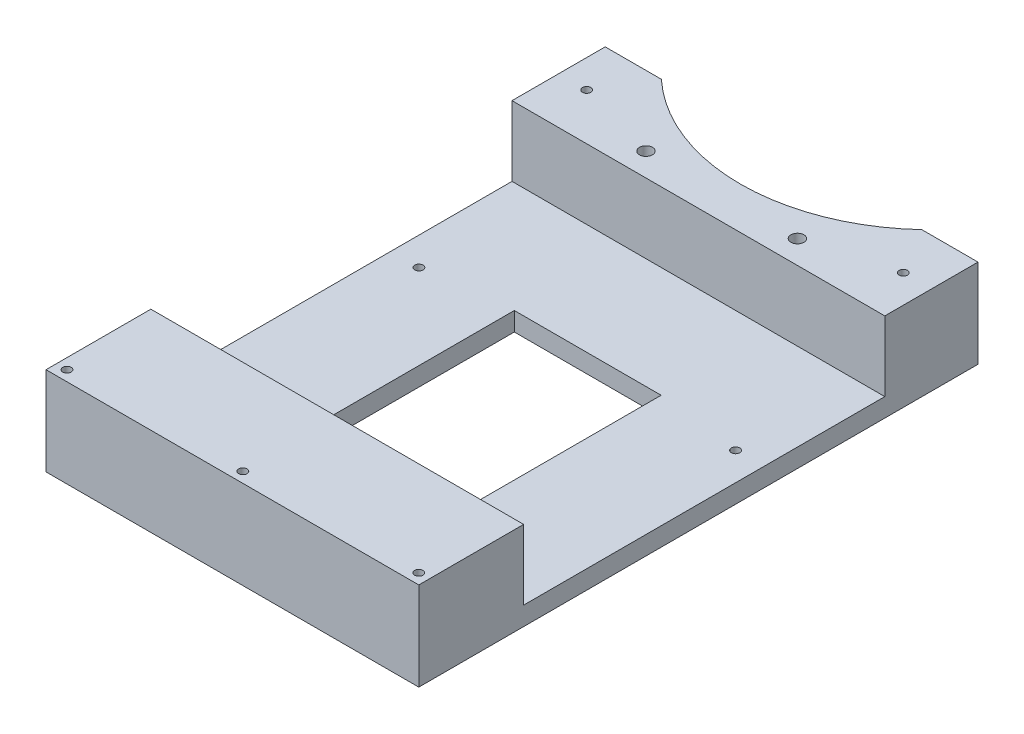
ISO-10303-21;
HEADER;
FILE_DESCRIPTION(('STEP AP214'),'2;1');
FILE_NAME('part.step','',(''),(''),'','','');
FILE_SCHEMA(('AUTOMOTIVE_DESIGN { 1 0 10303 214 1 1 1 1 }'));
ENDSEC;
DATA;
#1=APPLICATION_CONTEXT('core data for automotive mechanical design processes');
#2=APPLICATION_PROTOCOL_DEFINITION('international standard','automotive_design',2000,#1);
#3=PRODUCT_CONTEXT('',#1,'mechanical');
#4=PRODUCT('Part','Part','',(#3));
#5=PRODUCT_RELATED_PRODUCT_CATEGORY('part','',(#4));
#6=PRODUCT_DEFINITION_FORMATION('','',#4);
#7=PRODUCT_DEFINITION_CONTEXT('part definition',#1,'design');
#8=PRODUCT_DEFINITION('design','',#6,#7);
#9=PRODUCT_DEFINITION_SHAPE('','',#8);
#10=(LENGTH_UNIT() NAMED_UNIT(*) SI_UNIT(.MILLI.,.METRE.));
#11=(NAMED_UNIT(*) PLANE_ANGLE_UNIT() SI_UNIT($,.RADIAN.));
#12=(NAMED_UNIT(*) SI_UNIT($,.STERADIAN.) SOLID_ANGLE_UNIT());
#13=UNCERTAINTY_MEASURE_WITH_UNIT(LENGTH_MEASURE(1.E-05),#10,'distance_accuracy_value','');
#14=(GEOMETRIC_REPRESENTATION_CONTEXT(3) GLOBAL_UNCERTAINTY_ASSIGNED_CONTEXT((#13)) GLOBAL_UNIT_ASSIGNED_CONTEXT((#10,
#11,#12)) REPRESENTATION_CONTEXT('',''));
#15=CARTESIAN_POINT('',(0.,0.,0.));
#16=DIRECTION('',(0.,0.,1.));
#17=DIRECTION('',(1.,0.,0.));
#18=AXIS2_PLACEMENT_3D('',#15,#16,#17);
#19=CARTESIAN_POINT('',(4.99999999999989,4.,-82.5000000000002));
#20=DIRECTION('',(0.,-1.,0.));
#21=DIRECTION('',(0.,0.,-1.));
#22=AXIS2_PLACEMENT_3D('',#19,#20,#21);
#23=PLANE('',#22);
#24=CARTESIAN_POINT('',(38.9749999999999,4.,-6.50000000000017));
#25=DIRECTION('',(0.,-1.,0.));
#26=DIRECTION('',(0.,0.,1.));
#27=AXIS2_PLACEMENT_3D('',#24,#25,#26);
#28=CIRCLE('',#27,0.899999999999997);
#29=CARTESIAN_POINT('',(38.9749999999999,4.,-5.60000000000018));
#30=VERTEX_POINT('',#29);
#31=EDGE_CURVE('E308',#30,#30,#28,.T.);
#32=ORIENTED_EDGE('',*,*,#31,.T.);
#33=EDGE_LOOP('',(#32));
#34=FACE_BOUND('',#33,.T.);
#35=CARTESIAN_POINT('',(-28.9750000000001,4.,-6.50000000000017));
#36=DIRECTION('',(0.,-1.,0.));
#37=DIRECTION('',(0.,0.,1.));
#38=AXIS2_PLACEMENT_3D('',#35,#36,#37);
#39=CIRCLE('',#38,0.899999999999997);
#40=CARTESIAN_POINT('',(-28.9750000000001,4.,-5.60000000000018));
#41=VERTEX_POINT('',#40);
#42=EDGE_CURVE('E323',#41,#41,#39,.T.);
#43=ORIENTED_EDGE('',*,*,#42,.T.);
#44=EDGE_LOOP('',(#43));
#45=FACE_BOUND('',#44,.T.);
#46=DIRECTION('',(0.,0.,1.));
#47=VECTOR('',#46,1.);
#48=CARTESIAN_POINT('',(20.7499999999999,4.,40.7499999999998));
#49=LINE('',#48,#47);
#50=CARTESIAN_POINT('',(20.7499999999999,4.,-8.75000000000017));
#51=VERTEX_POINT('',#50);
#52=CARTESIAN_POINT('',(20.7499999999999,4.,40.7499999999998));
#53=VERTEX_POINT('',#52);
#54=EDGE_CURVE('E345',#51,#53,#49,.T.);
#55=ORIENTED_EDGE('',*,*,#54,.T.);
#56=DIRECTION('',(-1.,0.,0.));
#57=VECTOR('',#56,1.);
#58=CARTESIAN_POINT('',(-10.7500000000001,4.,40.7499999999998));
#59=LINE('',#58,#57);
#60=CARTESIAN_POINT('',(-10.7500000000001,4.,40.7499999999998));
#61=VERTEX_POINT('',#60);
#62=EDGE_CURVE('E335',#53,#61,#59,.T.);
#63=ORIENTED_EDGE('',*,*,#62,.T.);
#64=DIRECTION('',(0.,0.,-1.));
#65=VECTOR('',#64,1.);
#66=CARTESIAN_POINT('',(-10.7500000000001,4.,-8.75000000000018));
#67=LINE('',#66,#65);
#68=CARTESIAN_POINT('',(-10.7500000000001,4.,-8.75000000000017));
#69=VERTEX_POINT('',#68);
#70=EDGE_CURVE('E338',#61,#69,#67,.T.);
#71=ORIENTED_EDGE('',*,*,#70,.T.);
#72=DIRECTION('',(1.,0.,0.));
#73=VECTOR('',#72,1.);
#74=CARTESIAN_POINT('',(20.7499999999999,4.,-8.75000000000017));
#75=LINE('',#74,#73);
#76=EDGE_CURVE('E342',#69,#51,#75,.T.);
#77=ORIENTED_EDGE('',*,*,#76,.T.);
#78=EDGE_LOOP('',(#55,#63,#71,#77));
#79=FACE_BOUND('',#78,.T.);
#80=DIRECTION('',(1.,0.,0.));
#81=VECTOR('',#80,1.);
#82=CARTESIAN_POINT('',(44.9999999999999,4.,-32.5000000000002));
#83=LINE('',#82,#81);
#84=CARTESIAN_POINT('',(-35.0000000000001,4.,-32.5000000000002));
#85=VERTEX_POINT('',#84);
#86=CARTESIAN_POINT('',(44.9999999999999,4.,-32.5000000000002));
#87=VERTEX_POINT('',#86);
#88=EDGE_CURVE('E257',#85,#87,#83,.T.);
#89=ORIENTED_EDGE('',*,*,#88,.F.);
#90=DIRECTION('',(0.,0.,-1.));
#91=VECTOR('',#90,1.);
#92=CARTESIAN_POINT('',(-35.0000000000001,4.,67.4999999999998));
#93=LINE('',#92,#91);
#94=CARTESIAN_POINT('',(-35.0000000000001,4.,44.9999999999998));
#95=VERTEX_POINT('',#94);
#96=EDGE_CURVE('E369',#95,#85,#93,.T.);
#97=ORIENTED_EDGE('',*,*,#96,.F.);
#98=DIRECTION('',(-1.,0.,0.));
#99=VECTOR('',#98,1.);
#100=CARTESIAN_POINT('',(44.9999999999999,4.,44.9999999999998));
#101=LINE('',#100,#99);
#102=CARTESIAN_POINT('',(-31.0000000000001,4.,44.9999999999998));
#103=VERTEX_POINT('',#102);
#104=EDGE_CURVE('E280',#103,#95,#101,.T.);
#105=ORIENTED_EDGE('',*,*,#104,.F.);
#106=DIRECTION('',(0.,0.,-1.));
#107=VECTOR('',#106,1.);
#108=CARTESIAN_POINT('',(-31.0000000000001,4.,140.33543093852));
#109=LINE('',#108,#107);
#110=CARTESIAN_POINT('',(-31.0000000000001,4.,63.4999999999998));
#111=VERTEX_POINT('',#110);
#112=EDGE_CURVE('E51',#111,#103,#109,.T.);
#113=ORIENTED_EDGE('',*,*,#112,.F.);
#114=DIRECTION('',(-1.,0.,0.));
#115=VECTOR('',#114,1.);
#116=CARTESIAN_POINT('',(-31.0000000000001,4.,63.4999999999998));
#117=LINE('',#116,#115);
#118=CARTESIAN_POINT('',(40.9999999999999,3.99999999999999,63.4999999999998));
#119=VERTEX_POINT('',#118);
#120=EDGE_CURVE('E216',#119,#111,#117,.T.);
#121=ORIENTED_EDGE('',*,*,#120,.F.);
#122=DIRECTION('',(0.,0.,-1.));
#123=VECTOR('',#122,1.);
#124=CARTESIAN_POINT('',(40.9999999999999,3.99999999999999,140.33543093852));
#125=LINE('',#124,#123);
#126=CARTESIAN_POINT('',(40.9999999999999,3.99999999999999,44.9999999999998));
#127=VERTEX_POINT('',#126);
#128=EDGE_CURVE('E191',#119,#127,#125,.T.);
#129=ORIENTED_EDGE('',*,*,#128,.T.);
#130=CARTESIAN_POINT('',(44.9999999999999,4.,44.9999999999998));
#131=VERTEX_POINT('',#130);
#132=EDGE_CURVE('E285',#131,#127,#101,.T.);
#133=ORIENTED_EDGE('',*,*,#132,.F.);
#134=DIRECTION('',(0.,0.,1.));
#135=VECTOR('',#134,1.);
#136=CARTESIAN_POINT('',(44.9999999999999,4.,-52.5000000000002));
#137=LINE('',#136,#135);
#138=EDGE_CURVE('E367',#87,#131,#137,.T.);
#139=ORIENTED_EDGE('',*,*,#138,.F.);
#140=EDGE_LOOP('',(#89,#97,#105,#113,#121,#129,#133,#139));
#141=FACE_BOUND('',#140,.T.);
#142=ADVANCED_FACE('F34',(#34,#45,#79,#141),#23,.F.);
#143=CARTESIAN_POINT('',(4.99999999999989,4.,-82.5000000000002));
#144=DIRECTION('',(0.,-1.,0.));
#145=DIRECTION('',(0.,0.,-1.));
#146=AXIS2_PLACEMENT_3D('',#143,#144,#145);
#147=CYLINDRICAL_SURFACE('',#146,41.);
#148=CARTESIAN_POINT('',(4.99999999999989,0.,-82.5000000000002));
#149=DIRECTION('',(0.,1.,0.));
#150=DIRECTION('',(0.,0.,-1.));
#151=AXIS2_PLACEMENT_3D('',#148,#149,#150);
#152=CIRCLE('',#151,41.);
#153=CARTESIAN_POINT('',(-22.9463772249644,0.,-52.5000000000002));
#154=VERTEX_POINT('',#153);
#155=CARTESIAN_POINT('',(32.9463772249641,0.,-52.5000000000002));
#156=VERTEX_POINT('',#155);
#157=EDGE_CURVE('E360',#154,#156,#152,.T.);
#158=ORIENTED_EDGE('',*,*,#157,.F.);
#159=DIRECTION('',(0.,-1.,0.));
#160=VECTOR('',#159,1.);
#161=CARTESIAN_POINT('',(-22.9463772249644,4.,-52.5000000000002));
#162=LINE('',#161,#160);
#163=CARTESIAN_POINT('',(-22.9463772249644,19.,-52.5000000000002));
#164=VERTEX_POINT('',#163);
#165=EDGE_CURVE('E12',#164,#154,#162,.T.);
#166=ORIENTED_EDGE('',*,*,#165,.F.);
#167=CARTESIAN_POINT('',(4.99999999999988,19.,-82.5000000000002));
#168=DIRECTION('',(0.,-1.,0.));
#169=DIRECTION('',(0.,0.,1.));
#170=AXIS2_PLACEMENT_3D('',#167,#168,#169);
#171=CIRCLE('',#170,41.);
#172=CARTESIAN_POINT('',(32.9463772249641,19.,-52.5000000000002));
#173=VERTEX_POINT('',#172);
#174=EDGE_CURVE('E264',#173,#164,#171,.T.);
#175=ORIENTED_EDGE('',*,*,#174,.F.);
#176=DIRECTION('',(0.,-1.,0.));
#177=VECTOR('',#176,1.);
#178=CARTESIAN_POINT('',(32.9463772249641,4.,-52.5000000000002));
#179=LINE('',#178,#177);
#180=EDGE_CURVE('E38',#173,#156,#179,.T.);
#181=ORIENTED_EDGE('',*,*,#180,.T.);
#182=EDGE_LOOP('',(#158,#166,#175,#181));
#183=FACE_BOUND('',#182,.T.);
#184=ADVANCED_FACE('F36',(#183),#147,.F.);
#185=CARTESIAN_POINT('',(-35.0000000000001,4.,-52.5000000000002));
#186=DIRECTION('',(0.,0.,-1.));
#187=DIRECTION('',(-1.,0.,0.));
#188=AXIS2_PLACEMENT_3D('',#185,#186,#187);
#189=PLANE('',#188);
#190=DIRECTION('',(1.,0.,0.));
#191=VECTOR('',#190,1.);
#192=CARTESIAN_POINT('',(-35.0000000000001,0.,-52.5000000000002));
#193=LINE('',#192,#191);
#194=CARTESIAN_POINT('',(-35.0000000000001,0.,-52.5000000000002));
#195=VERTEX_POINT('',#194);
#196=EDGE_CURVE('E370',#195,#154,#193,.T.);
#197=ORIENTED_EDGE('',*,*,#196,.F.);
#198=DIRECTION('',(0.,-1.,0.));
#199=VECTOR('',#198,1.);
#200=CARTESIAN_POINT('',(-35.0000000000001,4.,-52.5000000000002));
#201=LINE('',#200,#199);
#202=CARTESIAN_POINT('',(-35.0000000000001,19.,-52.5000000000002));
#203=VERTEX_POINT('',#202);
#204=EDGE_CURVE('E43',#203,#195,#201,.T.);
#205=ORIENTED_EDGE('',*,*,#204,.F.);
#206=DIRECTION('',(-1.,0.,0.));
#207=VECTOR('',#206,1.);
#208=CARTESIAN_POINT('',(-35.0000000000001,19.,-52.5000000000002));
#209=LINE('',#208,#207);
#210=EDGE_CURVE('E267',#164,#203,#209,.T.);
#211=ORIENTED_EDGE('',*,*,#210,.F.);
#212=ORIENTED_EDGE('',*,*,#165,.T.);
#213=EDGE_LOOP('',(#197,#205,#211,#212));
#214=FACE_BOUND('',#213,.T.);
#215=ADVANCED_FACE('F407',(#214),#189,.T.);
#216=CARTESIAN_POINT('',(-35.0000000000001,4.,67.4999999999998));
#217=DIRECTION('',(-1.,0.,0.));
#218=DIRECTION('',(0.,0.,1.));
#219=AXIS2_PLACEMENT_3D('',#216,#217,#218);
#220=PLANE('',#219);
#221=DIRECTION('',(0.,0.,-1.));
#222=VECTOR('',#221,1.);
#223=CARTESIAN_POINT('',(-35.0000000000001,0.,67.4999999999998));
#224=LINE('',#223,#222);
#225=CARTESIAN_POINT('',(-35.0000000000001,0.,67.4999999999998));
#226=VERTEX_POINT('',#225);
#227=EDGE_CURVE('E384',#226,#195,#224,.T.);
#228=ORIENTED_EDGE('',*,*,#227,.F.);
#229=DIRECTION('',(0.,-1.,0.));
#230=VECTOR('',#229,1.);
#231=CARTESIAN_POINT('',(-35.0000000000001,4.,67.4999999999998));
#232=LINE('',#231,#230);
#233=CARTESIAN_POINT('',(-35.0000000000001,19.,67.4999999999998));
#234=VERTEX_POINT('',#233);
#235=EDGE_CURVE('E390',#234,#226,#232,.T.);
#236=ORIENTED_EDGE('',*,*,#235,.F.);
#237=DIRECTION('',(0.,0.,1.));
#238=VECTOR('',#237,1.);
#239=CARTESIAN_POINT('',(-35.0000000000001,19.,67.4999999999998));
#240=LINE('',#239,#238);
#241=CARTESIAN_POINT('',(-35.0000000000001,19.,44.9999999999998));
#242=VERTEX_POINT('',#241);
#243=EDGE_CURVE('E287',#242,#234,#240,.T.);
#244=ORIENTED_EDGE('',*,*,#243,.F.);
#245=DIRECTION('',(0.,-1.,0.));
#246=VECTOR('',#245,1.);
#247=CARTESIAN_POINT('',(-35.0000000000001,19.,44.9999999999998));
#248=LINE('',#247,#246);
#249=EDGE_CURVE('E293',#242,#95,#248,.T.);
#250=ORIENTED_EDGE('',*,*,#249,.T.);
#251=ORIENTED_EDGE('',*,*,#96,.T.);
#252=DIRECTION('',(0.,-1.,0.));
#253=VECTOR('',#252,1.);
#254=CARTESIAN_POINT('',(-35.0000000000001,19.,-32.5000000000002));
#255=LINE('',#254,#253);
#256=CARTESIAN_POINT('',(-35.0000000000001,19.,-32.5000000000002));
#257=VERTEX_POINT('',#256);
#258=EDGE_CURVE('E278',#257,#85,#255,.T.);
#259=ORIENTED_EDGE('',*,*,#258,.F.);
#260=DIRECTION('',(0.,0.,1.));
#261=VECTOR('',#260,1.);
#262=CARTESIAN_POINT('',(-35.0000000000001,19.,-32.5000000000002));
#263=LINE('',#262,#261);
#264=EDGE_CURVE('E270',#203,#257,#263,.T.);
#265=ORIENTED_EDGE('',*,*,#264,.F.);
#266=ORIENTED_EDGE('',*,*,#204,.T.);
#267=EDGE_LOOP('',(#228,#236,#244,#250,#251,#259,#265,#266));
#268=FACE_BOUND('',#267,.T.);
#269=ADVANCED_FACE('F425',(#268),#220,.T.);
#270=CARTESIAN_POINT('',(44.9999999999999,4.,67.4999999999998));
#271=DIRECTION('',(0.,0.,1.));
#272=DIRECTION('',(1.,0.,0.));
#273=AXIS2_PLACEMENT_3D('',#270,#271,#272);
#274=PLANE('',#273);
#275=DIRECTION('',(-1.,0.,0.));
#276=VECTOR('',#275,1.);
#277=CARTESIAN_POINT('',(44.9999999999999,0.,67.4999999999998));
#278=LINE('',#277,#276);
#279=CARTESIAN_POINT('',(44.9999999999999,0.,67.4999999999998));
#280=VERTEX_POINT('',#279);
#281=EDGE_CURVE('E381',#280,#226,#278,.T.);
#282=ORIENTED_EDGE('',*,*,#281,.F.);
#283=DIRECTION('',(0.,-1.,0.));
#284=VECTOR('',#283,1.);
#285=CARTESIAN_POINT('',(44.9999999999999,4.,67.4999999999998));
#286=LINE('',#285,#284);
#287=CARTESIAN_POINT('',(44.9999999999999,19.,67.4999999999998));
#288=VERTEX_POINT('',#287);
#289=EDGE_CURVE('E392',#288,#280,#286,.T.);
#290=ORIENTED_EDGE('',*,*,#289,.F.);
#291=DIRECTION('',(1.,0.,0.));
#292=VECTOR('',#291,1.);
#293=CARTESIAN_POINT('',(44.9999999999999,19.,67.4999999999998));
#294=LINE('',#293,#292);
#295=EDGE_CURVE('E290',#234,#288,#294,.T.);
#296=ORIENTED_EDGE('',*,*,#295,.F.);
#297=ORIENTED_EDGE('',*,*,#235,.T.);
#298=EDGE_LOOP('',(#282,#290,#296,#297));
#299=FACE_BOUND('',#298,.T.);
#300=ADVANCED_FACE('F421',(#299),#274,.T.);
#301=CARTESIAN_POINT('',(44.9999999999999,4.,-52.5000000000002));
#302=DIRECTION('',(1.,0.,0.));
#303=DIRECTION('',(0.,0.,-1.));
#304=AXIS2_PLACEMENT_3D('',#301,#302,#303);
#305=PLANE('',#304);
#306=DIRECTION('',(0.,0.,1.));
#307=VECTOR('',#306,1.);
#308=CARTESIAN_POINT('',(44.9999999999999,0.,-52.5000000000002));
#309=LINE('',#308,#307);
#310=CARTESIAN_POINT('',(44.9999999999999,0.,-52.5000000000002));
#311=VERTEX_POINT('',#310);
#312=EDGE_CURVE('E378',#311,#280,#309,.T.);
#313=ORIENTED_EDGE('',*,*,#312,.F.);
#314=DIRECTION('',(0.,-1.,0.));
#315=VECTOR('',#314,1.);
#316=CARTESIAN_POINT('',(44.9999999999999,4.,-52.5000000000002));
#317=LINE('',#316,#315);
#318=CARTESIAN_POINT('',(44.9999999999999,19.,-52.5000000000002));
#319=VERTEX_POINT('',#318);
#320=EDGE_CURVE('E393',#319,#311,#317,.T.);
#321=ORIENTED_EDGE('',*,*,#320,.F.);
#322=DIRECTION('',(0.,0.,-1.));
#323=VECTOR('',#322,1.);
#324=CARTESIAN_POINT('',(44.9999999999999,19.,-32.5000000000002));
#325=LINE('',#324,#323);
#326=CARTESIAN_POINT('',(44.9999999999999,19.,-32.5000000000002));
#327=VERTEX_POINT('',#326);
#328=EDGE_CURVE('E258',#327,#319,#325,.T.);
#329=ORIENTED_EDGE('',*,*,#328,.F.);
#330=DIRECTION('',(0.,-1.,0.));
#331=VECTOR('',#330,1.);
#332=CARTESIAN_POINT('',(44.9999999999999,19.,-32.5000000000002));
#333=LINE('',#332,#331);
#334=EDGE_CURVE('E274',#327,#87,#333,.T.);
#335=ORIENTED_EDGE('',*,*,#334,.T.);
#336=ORIENTED_EDGE('',*,*,#138,.T.);
#337=DIRECTION('',(0.,-1.,0.));
#338=VECTOR('',#337,1.);
#339=CARTESIAN_POINT('',(44.9999999999999,19.,44.9999999999998));
#340=LINE('',#339,#338);
#341=CARTESIAN_POINT('',(44.9999999999999,19.,44.9999999999998));
#342=VERTEX_POINT('',#341);
#343=EDGE_CURVE('E298',#342,#131,#340,.T.);
#344=ORIENTED_EDGE('',*,*,#343,.F.);
#345=DIRECTION('',(0.,0.,-1.));
#346=VECTOR('',#345,1.);
#347=CARTESIAN_POINT('',(44.9999999999999,19.,67.4999999999998));
#348=LINE('',#347,#346);
#349=EDGE_CURVE('E281',#288,#342,#348,.T.);
#350=ORIENTED_EDGE('',*,*,#349,.F.);
#351=ORIENTED_EDGE('',*,*,#289,.T.);
#352=EDGE_LOOP('',(#313,#321,#329,#335,#336,#344,#350,#351));
#353=FACE_BOUND('',#352,.T.);
#354=ADVANCED_FACE('F416',(#353),#305,.T.);
#355=CARTESIAN_POINT('',(32.9463772249641,4.,-52.5000000000002));
#356=DIRECTION('',(0.,0.,-1.));
#357=DIRECTION('',(-1.,0.,0.));
#358=AXIS2_PLACEMENT_3D('',#355,#356,#357);
#359=PLANE('',#358);
#360=DIRECTION('',(1.,0.,0.));
#361=VECTOR('',#360,1.);
#362=CARTESIAN_POINT('',(32.9463772249641,0.,-52.5000000000002));
#363=LINE('',#362,#361);
#364=EDGE_CURVE('E375',#156,#311,#363,.T.);
#365=ORIENTED_EDGE('',*,*,#364,.F.);
#366=ORIENTED_EDGE('',*,*,#180,.F.);
#367=DIRECTION('',(-1.,0.,0.));
#368=VECTOR('',#367,1.);
#369=CARTESIAN_POINT('',(32.9463772249641,19.,-52.5000000000002));
#370=LINE('',#369,#368);
#371=EDGE_CURVE('E261',#319,#173,#370,.T.);
#372=ORIENTED_EDGE('',*,*,#371,.F.);
#373=ORIENTED_EDGE('',*,*,#320,.T.);
#374=EDGE_LOOP('',(#365,#366,#372,#373));
#375=FACE_BOUND('',#374,.T.);
#376=ADVANCED_FACE('F401',(#375),#359,.T.);
#377=CARTESIAN_POINT('',(4.99999999999989,0.,-82.5000000000002));
#378=DIRECTION('',(0.,-1.,0.));
#379=DIRECTION('',(0.,0.,-1.));
#380=AXIS2_PLACEMENT_3D('',#377,#378,#379);
#381=PLANE('',#380);
#382=CARTESIAN_POINT('',(-28.9750000000001,0.,-42.5000000000001));
#383=DIRECTION('',(0.,1.,0.));
#384=DIRECTION('',(0.,0.,1.));
#385=AXIS2_PLACEMENT_3D('',#382,#383,#384);
#386=CIRCLE('',#385,0.899999999999996);
#387=CARTESIAN_POINT('',(-28.1580065312772,0.,-42.1224795739777));
#388=VERTEX_POINT('',#387);
#389=CARTESIAN_POINT('',(-29.791993468723,0.,-42.1224795739777));
#390=VERTEX_POINT('',#389);
#391=EDGE_CURVE('E231',#388,#390,#386,.T.);
#392=ORIENTED_EDGE('',*,*,#391,.T.);
#393=CARTESIAN_POINT('',(-28.9750000000001,0.,-41.7449591479553));
#394=DIRECTION('',(0.,-1.,0.));
#395=DIRECTION('',(0.,0.,-1.));
#396=AXIS2_PLACEMENT_3D('',#393,#394,#395);
#397=CIRCLE('',#396,0.9);
#398=EDGE_CURVE('E301',#388,#390,#397,.T.);
#399=ORIENTED_EDGE('',*,*,#398,.F.);
#400=EDGE_LOOP('',(#392,#399));
#401=FACE_BOUND('',#400,.T.);
#402=CARTESIAN_POINT('',(38.9749999999999,0.,-42.5000000000002));
#403=DIRECTION('',(0.,1.,0.));
#404=DIRECTION('',(0.,0.,1.));
#405=AXIS2_PLACEMENT_3D('',#402,#403,#404);
#406=CIRCLE('',#405,0.899999999999996);
#407=CARTESIAN_POINT('',(39.7919934687228,0.,-42.1224795739777));
#408=VERTEX_POINT('',#407);
#409=CARTESIAN_POINT('',(38.158006531277,0.,-42.1224795739777));
#410=VERTEX_POINT('',#409);
#411=EDGE_CURVE('E243',#408,#410,#406,.T.);
#412=ORIENTED_EDGE('',*,*,#411,.T.);
#413=CARTESIAN_POINT('',(38.9749999999999,0.,-41.7449591479553));
#414=DIRECTION('',(0.,-1.,0.));
#415=DIRECTION('',(0.,0.,-1.));
#416=AXIS2_PLACEMENT_3D('',#413,#414,#415);
#417=CIRCLE('',#416,0.899999999999996);
#418=EDGE_CURVE('E326',#408,#410,#417,.T.);
#419=ORIENTED_EDGE('',*,*,#418,.F.);
#420=EDGE_LOOP('',(#412,#419));
#421=FACE_BOUND('',#420,.T.);
#422=CARTESIAN_POINT('',(38.9749999999999,0.,-6.50000000000017));
#423=DIRECTION('',(0.,-1.,0.));
#424=DIRECTION('',(0.,0.,1.));
#425=AXIS2_PLACEMENT_3D('',#422,#423,#424);
#426=CIRCLE('',#425,0.899999999999997);
#427=CARTESIAN_POINT('',(38.9749999999999,0.,-5.60000000000018));
#428=VERTEX_POINT('',#427);
#429=EDGE_CURVE('E305',#428,#428,#426,.T.);
#430=ORIENTED_EDGE('',*,*,#429,.F.);
#431=EDGE_LOOP('',(#430));
#432=FACE_BOUND('',#431,.T.);
#433=CARTESIAN_POINT('',(42.7499999999999,0.,65.2499999999998));
#434=DIRECTION('',(0.,-1.,0.));
#435=DIRECTION('',(0.,0.,1.));
#436=AXIS2_PLACEMENT_3D('',#433,#434,#435);
#437=CIRCLE('',#436,0.900000000000012);
#438=CARTESIAN_POINT('',(42.7499999999999,0.,66.1499999999998));
#439=VERTEX_POINT('',#438);
#440=EDGE_CURVE('E311',#439,#439,#437,.T.);
#441=ORIENTED_EDGE('',*,*,#440,.F.);
#442=EDGE_LOOP('',(#441));
#443=FACE_BOUND('',#442,.T.);
#444=CARTESIAN_POINT('',(4.99999999999989,0.,65.2499999999998));
#445=DIRECTION('',(0.,-1.,0.));
#446=DIRECTION('',(0.,0.,1.));
#447=AXIS2_PLACEMENT_3D('',#444,#445,#446);
#448=CIRCLE('',#447,0.90000000000001);
#449=CARTESIAN_POINT('',(4.99999999999989,0.,66.1499999999998));
#450=VERTEX_POINT('',#449);
#451=EDGE_CURVE('E316',#450,#450,#448,.T.);
#452=ORIENTED_EDGE('',*,*,#451,.F.);
#453=EDGE_LOOP('',(#452));
#454=FACE_BOUND('',#453,.T.);
#455=CARTESIAN_POINT('',(-32.7500000000001,0.,65.2499999999998));
#456=DIRECTION('',(0.,-1.,0.));
#457=DIRECTION('',(0.,0.,1.));
#458=AXIS2_PLACEMENT_3D('',#455,#456,#457);
#459=CIRCLE('',#458,0.90000000000001);
#460=CARTESIAN_POINT('',(-32.7500000000001,0.,66.1499999999998));
#461=VERTEX_POINT('',#460);
#462=EDGE_CURVE('E319',#461,#461,#459,.T.);
#463=ORIENTED_EDGE('',*,*,#462,.F.);
#464=EDGE_LOOP('',(#463));
#465=FACE_BOUND('',#464,.T.);
#466=CARTESIAN_POINT('',(-28.9750000000001,0.,-6.50000000000017));
#467=DIRECTION('',(0.,-1.,0.));
#468=DIRECTION('',(0.,0.,1.));
#469=AXIS2_PLACEMENT_3D('',#466,#467,#468);
#470=CIRCLE('',#469,0.899999999999997);
#471=CARTESIAN_POINT('',(-28.9750000000001,0.,-5.60000000000018));
#472=VERTEX_POINT('',#471);
#473=EDGE_CURVE('E322',#472,#472,#470,.T.);
#474=ORIENTED_EDGE('',*,*,#473,.F.);
#475=EDGE_LOOP('',(#474));
#476=FACE_BOUND('',#475,.T.);
#477=DIRECTION('',(-1.,0.,0.));
#478=VECTOR('',#477,1.);
#479=CARTESIAN_POINT('',(-10.7500000000001,0.,40.7499999999998));
#480=LINE('',#479,#478);
#481=CARTESIAN_POINT('',(20.7499999999999,0.,40.7499999999998));
#482=VERTEX_POINT('',#481);
#483=CARTESIAN_POINT('',(-10.7500000000001,0.,40.7499999999998));
#484=VERTEX_POINT('',#483);
#485=EDGE_CURVE('E332',#482,#484,#480,.T.);
#486=ORIENTED_EDGE('',*,*,#485,.F.);
#487=DIRECTION('',(0.,0.,1.));
#488=VECTOR('',#487,1.);
#489=CARTESIAN_POINT('',(20.7499999999999,0.,40.7499999999998));
#490=LINE('',#489,#488);
#491=CARTESIAN_POINT('',(20.7499999999999,0.,-8.75000000000017));
#492=VERTEX_POINT('',#491);
#493=EDGE_CURVE('E339',#492,#482,#490,.T.);
#494=ORIENTED_EDGE('',*,*,#493,.F.);
#495=DIRECTION('',(1.,0.,0.));
#496=VECTOR('',#495,1.);
#497=CARTESIAN_POINT('',(20.7499999999999,0.,-8.75000000000017));
#498=LINE('',#497,#496);
#499=CARTESIAN_POINT('',(-10.7500000000001,0.,-8.75000000000018));
#500=VERTEX_POINT('',#499);
#501=EDGE_CURVE('E353',#500,#492,#498,.T.);
#502=ORIENTED_EDGE('',*,*,#501,.F.);
#503=DIRECTION('',(0.,0.,-1.));
#504=VECTOR('',#503,1.);
#505=CARTESIAN_POINT('',(-10.7500000000001,0.,-8.75000000000018));
#506=LINE('',#505,#504);
#507=EDGE_CURVE('E350',#484,#500,#506,.T.);
#508=ORIENTED_EDGE('',*,*,#507,.F.);
#509=EDGE_LOOP('',(#486,#494,#502,#508));
#510=FACE_BOUND('',#509,.T.);
#511=ORIENTED_EDGE('',*,*,#157,.T.);
#512=ORIENTED_EDGE('',*,*,#364,.T.);
#513=ORIENTED_EDGE('',*,*,#312,.T.);
#514=ORIENTED_EDGE('',*,*,#281,.T.);
#515=ORIENTED_EDGE('',*,*,#227,.T.);
#516=ORIENTED_EDGE('',*,*,#196,.T.);
#517=EDGE_LOOP('',(#511,#512,#513,#514,#515,#516));
#518=FACE_BOUND('',#517,.T.);
#519=ADVANCED_FACE('F403',(#401,#421,#432,#443,#454,#465,#476,#510,#518),#381,.T.);
#520=CARTESIAN_POINT('',(-10.7500000000001,4.,40.7499999999998));
#521=DIRECTION('',(0.,0.,1.));
#522=DIRECTION('',(1.,0.,0.));
#523=AXIS2_PLACEMENT_3D('',#520,#521,#522);
#524=PLANE('',#523);
#525=ORIENTED_EDGE('',*,*,#485,.T.);
#526=DIRECTION('',(0.,-1.,0.));
#527=VECTOR('',#526,1.);
#528=CARTESIAN_POINT('',(-10.7500000000001,4.,40.7499999999998));
#529=LINE('',#528,#527);
#530=EDGE_CURVE('E348',#61,#484,#529,.T.);
#531=ORIENTED_EDGE('',*,*,#530,.F.);
#532=ORIENTED_EDGE('',*,*,#62,.F.);
#533=DIRECTION('',(0.,-1.,0.));
#534=VECTOR('',#533,1.);
#535=CARTESIAN_POINT('',(20.7499999999999,4.,40.7499999999998));
#536=LINE('',#535,#534);
#537=EDGE_CURVE('E358',#53,#482,#536,.T.);
#538=ORIENTED_EDGE('',*,*,#537,.T.);
#539=EDGE_LOOP('',(#525,#531,#532,#538));
#540=FACE_BOUND('',#539,.T.);
#541=ADVANCED_FACE('F464',(#540),#524,.F.);
#542=CARTESIAN_POINT('',(20.7499999999999,4.,40.7499999999998));
#543=DIRECTION('',(1.,0.,0.));
#544=DIRECTION('',(0.,0.,-1.));
#545=AXIS2_PLACEMENT_3D('',#542,#543,#544);
#546=PLANE('',#545);
#547=ORIENTED_EDGE('',*,*,#493,.T.);
#548=ORIENTED_EDGE('',*,*,#537,.F.);
#549=ORIENTED_EDGE('',*,*,#54,.F.);
#550=DIRECTION('',(0.,-1.,0.));
#551=VECTOR('',#550,1.);
#552=CARTESIAN_POINT('',(20.7499999999999,4.,-8.75000000000017));
#553=LINE('',#552,#551);
#554=EDGE_CURVE('E361',#51,#492,#553,.T.);
#555=ORIENTED_EDGE('',*,*,#554,.T.);
#556=EDGE_LOOP('',(#547,#548,#549,#555));
#557=FACE_BOUND('',#556,.T.);
#558=ADVANCED_FACE('F493',(#557),#546,.F.);
#559=CARTESIAN_POINT('',(20.7499999999999,4.,-8.75000000000017));
#560=DIRECTION('',(0.,0.,-1.));
#561=DIRECTION('',(-1.,0.,0.));
#562=AXIS2_PLACEMENT_3D('',#559,#560,#561);
#563=PLANE('',#562);
#564=ORIENTED_EDGE('',*,*,#501,.T.);
#565=ORIENTED_EDGE('',*,*,#554,.F.);
#566=ORIENTED_EDGE('',*,*,#76,.F.);
#567=DIRECTION('',(0.,-1.,0.));
#568=VECTOR('',#567,1.);
#569=CARTESIAN_POINT('',(-10.7500000000001,4.,-8.75000000000018));
#570=LINE('',#569,#568);
#571=EDGE_CURVE('E363',#69,#500,#570,.T.);
#572=ORIENTED_EDGE('',*,*,#571,.T.);
#573=EDGE_LOOP('',(#564,#565,#566,#572));
#574=FACE_BOUND('',#573,.T.);
#575=ADVANCED_FACE('F500',(#574),#563,.F.);
#576=CARTESIAN_POINT('',(-10.7500000000001,4.,-8.75000000000018));
#577=DIRECTION('',(-1.,0.,0.));
#578=DIRECTION('',(0.,0.,1.));
#579=AXIS2_PLACEMENT_3D('',#576,#577,#578);
#580=PLANE('',#579);
#581=ORIENTED_EDGE('',*,*,#507,.T.);
#582=ORIENTED_EDGE('',*,*,#571,.F.);
#583=ORIENTED_EDGE('',*,*,#70,.F.);
#584=ORIENTED_EDGE('',*,*,#530,.T.);
#585=EDGE_LOOP('',(#581,#582,#583,#584));
#586=FACE_BOUND('',#585,.T.);
#587=ADVANCED_FACE('F508',(#586),#580,.F.);
#588=CARTESIAN_POINT('',(38.9749999999999,4.,-41.7449591479553));
#589=DIRECTION('',(0.,-1.,0.));
#590=DIRECTION('',(0.,0.,-1.));
#591=AXIS2_PLACEMENT_3D('',#588,#589,#590);
#592=CYLINDRICAL_SURFACE('',#591,0.899999999999996);
#593=CARTESIAN_POINT('',(38.9749999999999,4.,-41.7449591479553));
#594=DIRECTION('',(0.,-1.,0.));
#595=DIRECTION('',(0.,0.,-1.));
#596=AXIS2_PLACEMENT_3D('',#593,#594,#595);
#597=CIRCLE('',#596,0.899999999999996);
#598=CARTESIAN_POINT('',(39.7919934687228,4.,-42.1224795739777));
#599=VERTEX_POINT('',#598);
#600=CARTESIAN_POINT('',(38.158006531277,4.,-42.1224795739777));
#601=VERTEX_POINT('',#600);
#602=EDGE_CURVE('E329',#599,#601,#597,.T.);
#603=ORIENTED_EDGE('',*,*,#602,.F.);
#604=DIRECTION('',(0.,1.,0.));
#605=VECTOR('',#604,1.);
#606=CARTESIAN_POINT('',(39.7919934687228,9.5,-42.1224795739777));
#607=LINE('',#606,#605);
#608=EDGE_CURVE('E254',#599,#408,#607,.F.);
#609=ORIENTED_EDGE('',*,*,#608,.T.);
#610=ORIENTED_EDGE('',*,*,#418,.T.);
#611=DIRECTION('',(0.,1.,0.));
#612=VECTOR('',#611,1.);
#613=CARTESIAN_POINT('',(38.158006531277,9.5,-42.1224795739777));
#614=LINE('',#613,#612);
#615=EDGE_CURVE('E251',#410,#601,#614,.T.);
#616=ORIENTED_EDGE('',*,*,#615,.T.);
#617=EDGE_LOOP('',(#603,#609,#610,#616));
#618=FACE_BOUND('',#617,.T.);
#619=ADVANCED_FACE('F516',(#618),#592,.F.);
#620=CARTESIAN_POINT('',(-28.9750000000001,4.,-6.50000000000017));
#621=DIRECTION('',(0.,-1.,0.));
#622=DIRECTION('',(0.,0.,-1.));
#623=AXIS2_PLACEMENT_3D('',#620,#621,#622);
#624=CYLINDRICAL_SURFACE('',#623,0.899999999999997);
#625=ORIENTED_EDGE('',*,*,#42,.F.);
#626=EDGE_LOOP('',(#625));
#627=FACE_BOUND('',#626,.T.);
#628=ORIENTED_EDGE('',*,*,#473,.T.);
#629=EDGE_LOOP('',(#628));
#630=FACE_BOUND('',#629,.T.);
#631=ADVANCED_FACE('F523',(#627,#630),#624,.F.);
#632=CARTESIAN_POINT('',(-32.7500000000001,4.,65.2499999999998));
#633=DIRECTION('',(0.,-1.,0.));
#634=DIRECTION('',(0.,0.,-1.));
#635=AXIS2_PLACEMENT_3D('',#632,#633,#634);
#636=CYLINDRICAL_SURFACE('',#635,0.90000000000001);
#637=ORIENTED_EDGE('',*,*,#462,.T.);
#638=EDGE_LOOP('',(#637));
#639=FACE_BOUND('',#638,.T.);
#640=CARTESIAN_POINT('',(-32.7500000000001,19.,65.2499999999998));
#641=DIRECTION('',(0.,-1.,0.));
#642=DIRECTION('',(0.,0.,-1.));
#643=AXIS2_PLACEMENT_3D('',#640,#641,#642);
#644=CIRCLE('',#643,0.900000000000003);
#645=CARTESIAN_POINT('',(-32.7500000000001,19.,64.3499999999998));
#646=VERTEX_POINT('',#645);
#647=EDGE_CURVE('E221',#646,#646,#644,.T.);
#648=ORIENTED_EDGE('',*,*,#647,.F.);
#649=EDGE_LOOP('',(#648));
#650=FACE_BOUND('',#649,.T.);
#651=ADVANCED_FACE('F531',(#639,#650),#636,.F.);
#652=CARTESIAN_POINT('',(4.99999999999989,4.,65.2499999999998));
#653=DIRECTION('',(0.,-1.,0.));
#654=DIRECTION('',(0.,0.,-1.));
#655=AXIS2_PLACEMENT_3D('',#652,#653,#654);
#656=CYLINDRICAL_SURFACE('',#655,0.90000000000001);
#657=ORIENTED_EDGE('',*,*,#451,.T.);
#658=EDGE_LOOP('',(#657));
#659=FACE_BOUND('',#658,.T.);
#660=CARTESIAN_POINT('',(4.99999999999989,19.,65.2499999999998));
#661=DIRECTION('',(0.,-1.,0.));
#662=DIRECTION('',(0.,0.,-1.));
#663=AXIS2_PLACEMENT_3D('',#660,#661,#662);
#664=CIRCLE('',#663,0.900000000000007);
#665=CARTESIAN_POINT('',(4.99999999999989,19.,64.3499999999998));
#666=VERTEX_POINT('',#665);
#667=EDGE_CURVE('E222',#666,#666,#664,.T.);
#668=ORIENTED_EDGE('',*,*,#667,.F.);
#669=EDGE_LOOP('',(#668));
#670=FACE_BOUND('',#669,.T.);
#671=ADVANCED_FACE('F540',(#659,#670),#656,.F.);
#672=CARTESIAN_POINT('',(42.7499999999999,4.,65.2499999999998));
#673=DIRECTION('',(0.,-1.,0.));
#674=DIRECTION('',(0.,0.,-1.));
#675=AXIS2_PLACEMENT_3D('',#672,#673,#674);
#676=CYLINDRICAL_SURFACE('',#675,0.900000000000012);
#677=ORIENTED_EDGE('',*,*,#440,.T.);
#678=EDGE_LOOP('',(#677));
#679=FACE_BOUND('',#678,.T.);
#680=CARTESIAN_POINT('',(42.7499999999999,19.,65.2499999999998));
#681=DIRECTION('',(0.,-1.,0.));
#682=DIRECTION('',(0.,0.,-1.));
#683=AXIS2_PLACEMENT_3D('',#680,#681,#682);
#684=CIRCLE('',#683,0.900000000000016);
#685=CARTESIAN_POINT('',(42.7499999999999,19.,64.3499999999998));
#686=VERTEX_POINT('',#685);
#687=EDGE_CURVE('E225',#686,#686,#684,.T.);
#688=ORIENTED_EDGE('',*,*,#687,.F.);
#689=EDGE_LOOP('',(#688));
#690=FACE_BOUND('',#689,.T.);
#691=ADVANCED_FACE('F549',(#679,#690),#676,.F.);
#692=CARTESIAN_POINT('',(38.9749999999999,4.,-6.50000000000017));
#693=DIRECTION('',(0.,-1.,0.));
#694=DIRECTION('',(0.,0.,-1.));
#695=AXIS2_PLACEMENT_3D('',#692,#693,#694);
#696=CYLINDRICAL_SURFACE('',#695,0.899999999999997);
#697=ORIENTED_EDGE('',*,*,#31,.F.);
#698=EDGE_LOOP('',(#697));
#699=FACE_BOUND('',#698,.T.);
#700=ORIENTED_EDGE('',*,*,#429,.T.);
#701=EDGE_LOOP('',(#700));
#702=FACE_BOUND('',#701,.T.);
#703=ADVANCED_FACE('F450',(#699,#702),#696,.F.);
#704=CARTESIAN_POINT('',(-28.9750000000001,4.,-41.7449591479553));
#705=DIRECTION('',(0.,-1.,0.));
#706=DIRECTION('',(0.,0.,-1.));
#707=AXIS2_PLACEMENT_3D('',#704,#705,#706);
#708=CYLINDRICAL_SURFACE('',#707,0.9);
#709=CARTESIAN_POINT('',(-28.9750000000001,4.,-41.7449591479553));
#710=DIRECTION('',(0.,-1.,0.));
#711=DIRECTION('',(0.,0.,-1.));
#712=AXIS2_PLACEMENT_3D('',#709,#710,#711);
#713=CIRCLE('',#712,0.9);
#714=CARTESIAN_POINT('',(-28.1580065312772,4.,-42.1224795739777));
#715=VERTEX_POINT('',#714);
#716=CARTESIAN_POINT('',(-29.791993468723,4.,-42.1224795739777));
#717=VERTEX_POINT('',#716);
#718=EDGE_CURVE('E302',#715,#717,#713,.T.);
#719=ORIENTED_EDGE('',*,*,#718,.F.);
#720=DIRECTION('',(0.,1.,0.));
#721=VECTOR('',#720,1.);
#722=CARTESIAN_POINT('',(-28.1580065312772,9.5,-42.1224795739777));
#723=LINE('',#722,#721);
#724=EDGE_CURVE('E59',#715,#388,#723,.F.);
#725=ORIENTED_EDGE('',*,*,#724,.T.);
#726=ORIENTED_EDGE('',*,*,#398,.T.);
#727=DIRECTION('',(0.,1.,0.));
#728=VECTOR('',#727,1.);
#729=CARTESIAN_POINT('',(-29.791993468723,9.5,-42.1224795739777));
#730=LINE('',#729,#728);
#731=EDGE_CURVE('E238',#390,#717,#730,.T.);
#732=ORIENTED_EDGE('',*,*,#731,.T.);
#733=EDGE_LOOP('',(#719,#725,#726,#732));
#734=FACE_BOUND('',#733,.T.);
#735=ADVANCED_FACE('F441',(#734),#708,.F.);
#736=CARTESIAN_POINT('',(0.,19.,0.));
#737=DIRECTION('',(0.,1.,0.));
#738=DIRECTION('',(0.,0.,1.));
#739=AXIS2_PLACEMENT_3D('',#736,#737,#738);
#740=PLANE('',#739);
#741=ORIENTED_EDGE('',*,*,#667,.T.);
#742=EDGE_LOOP('',(#741));
#743=FACE_BOUND('',#742,.T.);
#744=ORIENTED_EDGE('',*,*,#647,.T.);
#745=EDGE_LOOP('',(#744));
#746=FACE_BOUND('',#745,.T.);
#747=ORIENTED_EDGE('',*,*,#687,.T.);
#748=EDGE_LOOP('',(#747));
#749=FACE_BOUND('',#748,.T.);
#750=ORIENTED_EDGE('',*,*,#349,.T.);
#751=DIRECTION('',(-1.,0.,0.));
#752=VECTOR('',#751,1.);
#753=CARTESIAN_POINT('',(44.9999999999999,19.,44.9999999999998));
#754=LINE('',#753,#752);
#755=EDGE_CURVE('E284',#342,#242,#754,.T.);
#756=ORIENTED_EDGE('',*,*,#755,.T.);
#757=ORIENTED_EDGE('',*,*,#243,.T.);
#758=ORIENTED_EDGE('',*,*,#295,.T.);
#759=EDGE_LOOP('',(#750,#756,#757,#758));
#760=FACE_BOUND('',#759,.T.);
#761=ADVANCED_FACE('F439',(#743,#746,#749,#760),#740,.T.);
#762=CARTESIAN_POINT('',(44.9999999999999,19.,44.9999999999998));
#763=DIRECTION('',(0.,0.,1.));
#764=DIRECTION('',(1.,0.,0.));
#765=AXIS2_PLACEMENT_3D('',#762,#763,#764);
#766=PLANE('',#765);
#767=ORIENTED_EDGE('',*,*,#132,.T.);
#768=DIRECTION('',(0.,-1.,0.));
#769=VECTOR('',#768,1.);
#770=CARTESIAN_POINT('',(40.9999999999999,3.99999999999999,44.9999999999998));
#771=LINE('',#770,#769);
#772=CARTESIAN_POINT('',(40.9999999999999,15.,44.9999999999998));
#773=VERTEX_POINT('',#772);
#774=EDGE_CURVE('E207',#773,#127,#771,.T.);
#775=ORIENTED_EDGE('',*,*,#774,.F.);
#776=DIRECTION('',(1.,0.,0.));
#777=VECTOR('',#776,1.);
#778=CARTESIAN_POINT('',(-31.0000000000001,15.,44.9999999999998));
#779=LINE('',#778,#777);
#780=CARTESIAN_POINT('',(-31.0000000000001,15.,44.9999999999998));
#781=VERTEX_POINT('',#780);
#782=EDGE_CURVE('E201',#781,#773,#779,.T.);
#783=ORIENTED_EDGE('',*,*,#782,.F.);
#784=DIRECTION('',(0.,1.,0.));
#785=VECTOR('',#784,1.);
#786=CARTESIAN_POINT('',(-31.0000000000001,4.,44.9999999999998));
#787=LINE('',#786,#785);
#788=EDGE_CURVE('E212',#103,#781,#787,.T.);
#789=ORIENTED_EDGE('',*,*,#788,.F.);
#790=ORIENTED_EDGE('',*,*,#104,.T.);
#791=ORIENTED_EDGE('',*,*,#249,.F.);
#792=ORIENTED_EDGE('',*,*,#755,.F.);
#793=ORIENTED_EDGE('',*,*,#343,.T.);
#794=EDGE_LOOP('',(#767,#775,#783,#789,#790,#791,#792,#793));
#795=FACE_BOUND('',#794,.T.);
#796=ADVANCED_FACE('F436',(#795),#766,.F.);
#797=CARTESIAN_POINT('',(4.99999999999988,4.,-82.5000000000002));
#798=DIRECTION('',(0.,1.,0.));
#799=DIRECTION('',(0.,0.,1.));
#800=AXIS2_PLACEMENT_3D('',#797,#798,#799);
#801=PLANE('',#800);
#802=ORIENTED_EDGE('',*,*,#718,.T.);
#803=CARTESIAN_POINT('',(-28.9750000000001,4.,-42.5000000000001));
#804=DIRECTION('',(0.,1.,0.));
#805=DIRECTION('',(0.,0.,1.));
#806=AXIS2_PLACEMENT_3D('',#803,#804,#805);
#807=CIRCLE('',#806,0.899999999999996);
#808=EDGE_CURVE('E234',#717,#715,#807,.T.);
#809=ORIENTED_EDGE('',*,*,#808,.T.);
#810=EDGE_LOOP('',(#802,#809));
#811=FACE_BOUND('',#810,.T.);
#812=ADVANCED_FACE('F448',(#811),#801,.F.);
#813=ORIENTED_EDGE('',*,*,#602,.T.);
#814=CARTESIAN_POINT('',(38.9749999999999,4.,-42.5000000000002));
#815=DIRECTION('',(0.,1.,0.));
#816=DIRECTION('',(0.,0.,1.));
#817=AXIS2_PLACEMENT_3D('',#814,#815,#816);
#818=CIRCLE('',#817,0.899999999999996);
#819=EDGE_CURVE('E246',#601,#599,#818,.T.);
#820=ORIENTED_EDGE('',*,*,#819,.T.);
#821=EDGE_LOOP('',(#813,#820));
#822=FACE_BOUND('',#821,.T.);
#823=ADVANCED_FACE('F578',(#822),#801,.F.);
#824=CARTESIAN_POINT('',(44.9999999999999,19.,-32.5000000000002));
#825=DIRECTION('',(0.,0.,-1.));
#826=DIRECTION('',(-1.,0.,0.));
#827=AXIS2_PLACEMENT_3D('',#824,#825,#826);
#828=PLANE('',#827);
#829=ORIENTED_EDGE('',*,*,#88,.T.);
#830=ORIENTED_EDGE('',*,*,#334,.F.);
#831=DIRECTION('',(1.,0.,0.));
#832=VECTOR('',#831,1.);
#833=CARTESIAN_POINT('',(44.9999999999999,19.,-32.5000000000002));
#834=LINE('',#833,#832);
#835=EDGE_CURVE('E272',#257,#327,#834,.T.);
#836=ORIENTED_EDGE('',*,*,#835,.F.);
#837=ORIENTED_EDGE('',*,*,#258,.T.);
#838=EDGE_LOOP('',(#829,#830,#836,#837));
#839=FACE_BOUND('',#838,.T.);
#840=ADVANCED_FACE('F430',(#839),#828,.F.);
#841=CARTESIAN_POINT('',(4.99999999999988,19.,-82.5000000000002));
#842=DIRECTION('',(0.,1.,0.));
#843=DIRECTION('',(0.,0.,1.));
#844=AXIS2_PLACEMENT_3D('',#841,#842,#843);
#845=PLANE('',#844);
#846=CARTESIAN_POINT('',(-11.2500000000001,19.,-37.5000000000001));
#847=DIRECTION('',(0.,1.,0.));
#848=DIRECTION('',(0.,0.,1.));
#849=AXIS2_PLACEMENT_3D('',#846,#847,#848);
#850=CIRCLE('',#849,1.4);
#851=CARTESIAN_POINT('',(-11.2500000000001,19.,-36.1000000000001));
#852=VERTEX_POINT('',#851);
#853=EDGE_CURVE('E802',#852,#852,#850,.T.);
#854=ORIENTED_EDGE('',*,*,#853,.F.);
#855=EDGE_LOOP('',(#854));
#856=FACE_BOUND('',#855,.T.);
#857=CARTESIAN_POINT('',(21.2499999999999,19.,-37.5000000000001));
#858=DIRECTION('',(0.,1.,0.));
#859=DIRECTION('',(0.,0.,1.));
#860=AXIS2_PLACEMENT_3D('',#857,#858,#859);
#861=CIRCLE('',#860,1.4);
#862=CARTESIAN_POINT('',(21.2499999999999,19.,-36.1000000000002));
#863=VERTEX_POINT('',#862);
#864=EDGE_CURVE('E806',#863,#863,#861,.T.);
#865=ORIENTED_EDGE('',*,*,#864,.F.);
#866=EDGE_LOOP('',(#865));
#867=FACE_BOUND('',#866,.T.);
#868=CARTESIAN_POINT('',(-28.9750000000001,19.,-42.5000000000001));
#869=DIRECTION('',(0.,1.,0.));
#870=DIRECTION('',(0.,0.,1.));
#871=AXIS2_PLACEMENT_3D('',#868,#869,#870);
#872=CIRCLE('',#871,0.899999999999996);
#873=CARTESIAN_POINT('',(-28.9750000000001,19.,-41.6000000000002));
#874=VERTEX_POINT('',#873);
#875=EDGE_CURVE('E230',#874,#874,#872,.T.);
#876=ORIENTED_EDGE('',*,*,#875,.F.);
#877=EDGE_LOOP('',(#876));
#878=FACE_BOUND('',#877,.T.);
#879=CARTESIAN_POINT('',(38.9749999999999,19.,-42.5000000000002));
#880=DIRECTION('',(0.,1.,0.));
#881=DIRECTION('',(0.,0.,1.));
#882=AXIS2_PLACEMENT_3D('',#879,#880,#881);
#883=CIRCLE('',#882,0.899999999999996);
#884=CARTESIAN_POINT('',(38.9749999999999,19.,-41.6000000000002));
#885=VERTEX_POINT('',#884);
#886=EDGE_CURVE('E242',#885,#885,#883,.T.);
#887=ORIENTED_EDGE('',*,*,#886,.F.);
#888=EDGE_LOOP('',(#887));
#889=FACE_BOUND('',#888,.T.);
#890=ORIENTED_EDGE('',*,*,#328,.T.);
#891=ORIENTED_EDGE('',*,*,#371,.T.);
#892=ORIENTED_EDGE('',*,*,#174,.T.);
#893=ORIENTED_EDGE('',*,*,#210,.T.);
#894=ORIENTED_EDGE('',*,*,#264,.T.);
#895=ORIENTED_EDGE('',*,*,#835,.T.);
#896=EDGE_LOOP('',(#890,#891,#892,#893,#894,#895));
#897=FACE_BOUND('',#896,.T.);
#898=ADVANCED_FACE('F410',(#856,#867,#878,#889,#897),#845,.T.);
#899=CARTESIAN_POINT('',(38.9749999999999,0.,-42.5000000000002));
#900=DIRECTION('',(0.,1.,0.));
#901=DIRECTION('',(0.,0.,1.));
#902=AXIS2_PLACEMENT_3D('',#899,#900,#901);
#903=CYLINDRICAL_SURFACE('',#902,0.899999999999996);
#904=ORIENTED_EDGE('',*,*,#886,.T.);
#905=EDGE_LOOP('',(#904));
#906=FACE_BOUND('',#905,.T.);
#907=ORIENTED_EDGE('',*,*,#819,.F.);
#908=ORIENTED_EDGE('',*,*,#615,.F.);
#909=ORIENTED_EDGE('',*,*,#411,.F.);
#910=ORIENTED_EDGE('',*,*,#608,.F.);
#911=EDGE_LOOP('',(#907,#908,#909,#910));
#912=FACE_BOUND('',#911,.T.);
#913=ADVANCED_FACE('F595',(#906,#912),#903,.F.);
#914=CARTESIAN_POINT('',(-28.9750000000001,0.,-42.5000000000001));
#915=DIRECTION('',(0.,1.,0.));
#916=DIRECTION('',(0.,0.,1.));
#917=AXIS2_PLACEMENT_3D('',#914,#915,#916);
#918=CYLINDRICAL_SURFACE('',#917,0.899999999999996);
#919=ORIENTED_EDGE('',*,*,#875,.T.);
#920=EDGE_LOOP('',(#919));
#921=FACE_BOUND('',#920,.T.);
#922=ORIENTED_EDGE('',*,*,#808,.F.);
#923=ORIENTED_EDGE('',*,*,#731,.F.);
#924=ORIENTED_EDGE('',*,*,#391,.F.);
#925=ORIENTED_EDGE('',*,*,#724,.F.);
#926=EDGE_LOOP('',(#922,#923,#924,#925));
#927=FACE_BOUND('',#926,.T.);
#928=ADVANCED_FACE('F599',(#921,#927),#918,.F.);
#929=CARTESIAN_POINT('',(44.9999999999999,4.,63.4999999999998));
#930=DIRECTION('',(0.,0.,1.));
#931=DIRECTION('',(1.,0.,0.));
#932=AXIS2_PLACEMENT_3D('',#929,#930,#931);
#933=PLANE('',#932);
#934=DIRECTION('',(0.,1.,0.));
#935=VECTOR('',#934,1.);
#936=CARTESIAN_POINT('',(-31.0000000000001,4.,63.4999999999998));
#937=LINE('',#936,#935);
#938=CARTESIAN_POINT('',(-31.0000000000001,15.,63.4999999999998));
#939=VERTEX_POINT('',#938);
#940=EDGE_CURVE('E205',#111,#939,#937,.T.);
#941=ORIENTED_EDGE('',*,*,#940,.T.);
#942=DIRECTION('',(1.,0.,0.));
#943=VECTOR('',#942,1.);
#944=CARTESIAN_POINT('',(-31.0000000000001,15.,63.4999999999998));
#945=LINE('',#944,#943);
#946=CARTESIAN_POINT('',(40.9999999999999,15.,63.4999999999998));
#947=VERTEX_POINT('',#946);
#948=EDGE_CURVE('E198',#939,#947,#945,.T.);
#949=ORIENTED_EDGE('',*,*,#948,.T.);
#950=DIRECTION('',(0.,-1.,0.));
#951=VECTOR('',#950,1.);
#952=CARTESIAN_POINT('',(40.9999999999999,3.99999999999999,63.4999999999998));
#953=LINE('',#952,#951);
#954=EDGE_CURVE('E185',#947,#119,#953,.T.);
#955=ORIENTED_EDGE('',*,*,#954,.T.);
#956=ORIENTED_EDGE('',*,*,#120,.T.);
#957=EDGE_LOOP('',(#941,#949,#955,#956));
#958=FACE_BOUND('',#957,.T.);
#959=ADVANCED_FACE('F204',(#958),#933,.F.);
#960=CARTESIAN_POINT('',(-31.0000000000001,15.,140.33543093852));
#961=DIRECTION('',(0.,1.,0.));
#962=DIRECTION('',(-1.,0.,0.));
#963=AXIS2_PLACEMENT_3D('',#960,#961,#962);
#964=PLANE('',#963);
#965=DIRECTION('',(0.,0.,-1.));
#966=VECTOR('',#965,1.);
#967=CARTESIAN_POINT('',(-31.0000000000001,15.,140.33543093852));
#968=LINE('',#967,#966);
#969=EDGE_CURVE('E215',#939,#781,#968,.T.);
#970=ORIENTED_EDGE('',*,*,#969,.T.);
#971=ORIENTED_EDGE('',*,*,#782,.T.);
#972=DIRECTION('',(0.,0.,-1.));
#973=VECTOR('',#972,1.);
#974=CARTESIAN_POINT('',(40.9999999999999,15.,140.33543093852));
#975=LINE('',#974,#973);
#976=EDGE_CURVE('E189',#947,#773,#975,.T.);
#977=ORIENTED_EDGE('',*,*,#976,.F.);
#978=ORIENTED_EDGE('',*,*,#948,.F.);
#979=EDGE_LOOP('',(#970,#971,#977,#978));
#980=FACE_BOUND('',#979,.T.);
#981=ADVANCED_FACE('F197',(#980),#964,.F.);
#982=CARTESIAN_POINT('',(40.9999999999999,3.99999999999999,140.33543093852));
#983=DIRECTION('',(1.,0.,0.));
#984=DIRECTION('',(0.,1.,0.));
#985=AXIS2_PLACEMENT_3D('',#982,#983,#984);
#986=PLANE('',#985);
#987=ORIENTED_EDGE('',*,*,#976,.T.);
#988=ORIENTED_EDGE('',*,*,#774,.T.);
#989=ORIENTED_EDGE('',*,*,#128,.F.);
#990=ORIENTED_EDGE('',*,*,#954,.F.);
#991=EDGE_LOOP('',(#987,#988,#989,#990));
#992=FACE_BOUND('',#991,.T.);
#993=ADVANCED_FACE('F187',(#992),#986,.F.);
#994=CARTESIAN_POINT('',(-31.0000000000001,4.,140.33543093852));
#995=DIRECTION('',(-1.,0.,0.));
#996=DIRECTION('',(0.,-1.,0.));
#997=AXIS2_PLACEMENT_3D('',#994,#995,#996);
#998=PLANE('',#997);
#999=ORIENTED_EDGE('',*,*,#112,.T.);
#1000=ORIENTED_EDGE('',*,*,#788,.T.);
#1001=ORIENTED_EDGE('',*,*,#969,.F.);
#1002=ORIENTED_EDGE('',*,*,#940,.F.);
#1003=EDGE_LOOP('',(#999,#1000,#1001,#1002));
#1004=FACE_BOUND('',#1003,.T.);
#1005=ADVANCED_FACE('F632',(#1004),#998,.F.);
#1006=CARTESIAN_POINT('',(21.2499999999999,11.,-37.5000000000001));
#1007=DIRECTION('',(0.,1.,0.));
#1008=DIRECTION('',(0.,0.,1.));
#1009=AXIS2_PLACEMENT_3D('',#1006,#1007,#1008);
#1010=CYLINDRICAL_SURFACE('',#1009,1.4);
#1011=CARTESIAN_POINT('',(21.2499999999999,11.,-37.5000000000001));
#1012=DIRECTION('',(0.,1.,0.));
#1013=DIRECTION('',(0.,0.,1.));
#1014=AXIS2_PLACEMENT_3D('',#1011,#1012,#1013);
#1015=CIRCLE('',#1014,1.4);
#1016=CARTESIAN_POINT('',(21.2499999999999,11.,-36.1000000000002));
#1017=VERTEX_POINT('',#1016);
#1018=EDGE_CURVE('E846',#1017,#1017,#1015,.T.);
#1019=ORIENTED_EDGE('',*,*,#1018,.F.);
#1020=EDGE_LOOP('',(#1019));
#1021=FACE_BOUND('',#1020,.T.);
#1022=ORIENTED_EDGE('',*,*,#864,.T.);
#1023=EDGE_LOOP('',(#1022));
#1024=FACE_BOUND('',#1023,.T.);
#1025=ADVANCED_FACE('F639',(#1021,#1024),#1010,.F.);
#1026=CARTESIAN_POINT('',(21.2499999999999,11.,-37.5000000000001));
#1027=DIRECTION('',(0.,1.,0.));
#1028=DIRECTION('',(0.,0.,1.));
#1029=AXIS2_PLACEMENT_3D('',#1026,#1027,#1028);
#1030=PLANE('',#1029);
#1031=ORIENTED_EDGE('',*,*,#1018,.T.);
#1032=EDGE_LOOP('',(#1031));
#1033=FACE_BOUND('',#1032,.T.);
#1034=ADVANCED_FACE('F647',(#1033),#1030,.T.);
#1035=CARTESIAN_POINT('',(-11.2500000000001,11.,-37.5000000000001));
#1036=DIRECTION('',(0.,1.,0.));
#1037=DIRECTION('',(0.,0.,1.));
#1038=AXIS2_PLACEMENT_3D('',#1035,#1036,#1037);
#1039=CYLINDRICAL_SURFACE('',#1038,1.4);
#1040=CARTESIAN_POINT('',(-11.2500000000001,11.,-37.5000000000001));
#1041=DIRECTION('',(0.,1.,0.));
#1042=DIRECTION('',(0.,0.,1.));
#1043=AXIS2_PLACEMENT_3D('',#1040,#1041,#1042);
#1044=CIRCLE('',#1043,1.4);
#1045=CARTESIAN_POINT('',(-11.2500000000001,11.,-36.1000000000001));
#1046=VERTEX_POINT('',#1045);
#1047=EDGE_CURVE('E847',#1046,#1046,#1044,.T.);
#1048=ORIENTED_EDGE('',*,*,#1047,.F.);
#1049=EDGE_LOOP('',(#1048));
#1050=FACE_BOUND('',#1049,.T.);
#1051=ORIENTED_EDGE('',*,*,#853,.T.);
#1052=EDGE_LOOP('',(#1051));
#1053=FACE_BOUND('',#1052,.T.);
#1054=ADVANCED_FACE('F655',(#1050,#1053),#1039,.F.);
#1055=CARTESIAN_POINT('',(-11.2500000000001,11.,-37.5000000000001));
#1056=DIRECTION('',(0.,1.,0.));
#1057=DIRECTION('',(0.,0.,1.));
#1058=AXIS2_PLACEMENT_3D('',#1055,#1056,#1057);
#1059=PLANE('',#1058);
#1060=ORIENTED_EDGE('',*,*,#1047,.T.);
#1061=EDGE_LOOP('',(#1060));
#1062=FACE_BOUND('',#1061,.T.);
#1063=ADVANCED_FACE('F663',(#1062),#1059,.T.);
#1064=CLOSED_SHELL('',(#142,#184,#215,#269,#300,#354,#376,#519,#541,#558,#575,#587,#619,#631,
#651,#671,#691,#703,#735,#761,#796,#812,#823,#840,#898,#913,#928,#959,#981,#993,#1005,#1025,
#1034,#1054,#1063));
#1065=MANIFOLD_SOLID_BREP('B2',#1064);
#1066=ADVANCED_BREP_SHAPE_REPRESENTATION('',(#18,#1065),#14);
#1067=SHAPE_DEFINITION_REPRESENTATION(#9,#1066);
ENDSEC;
END-ISO-10303-21;
